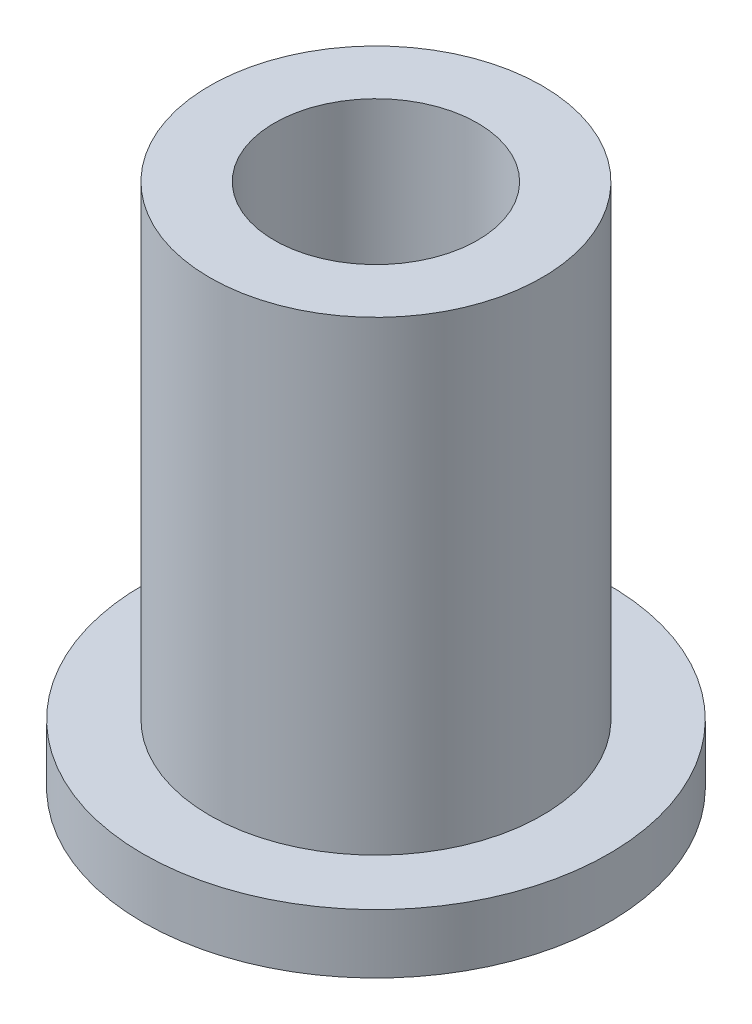
ISO-10303-21;
HEADER;
FILE_DESCRIPTION(('STEP AP214'),'2;1');
FILE_NAME('part.step','',(''),(''),'','','');
FILE_SCHEMA(('AUTOMOTIVE_DESIGN { 1 0 10303 214 1 1 1 1 }'));
ENDSEC;
DATA;
#1=APPLICATION_CONTEXT('core data for automotive mechanical design processes');
#2=APPLICATION_PROTOCOL_DEFINITION('international standard','automotive_design',2000,#1);
#3=PRODUCT_CONTEXT('',#1,'mechanical');
#4=PRODUCT('Part','Part','',(#3));
#5=PRODUCT_RELATED_PRODUCT_CATEGORY('part','',(#4));
#6=PRODUCT_DEFINITION_FORMATION('','',#4);
#7=PRODUCT_DEFINITION_CONTEXT('part definition',#1,'design');
#8=PRODUCT_DEFINITION('design','',#6,#7);
#9=PRODUCT_DEFINITION_SHAPE('','',#8);
#10=(LENGTH_UNIT() NAMED_UNIT(*) SI_UNIT(.MILLI.,.METRE.));
#11=(NAMED_UNIT(*) PLANE_ANGLE_UNIT() SI_UNIT($,.RADIAN.));
#12=(NAMED_UNIT(*) SI_UNIT($,.STERADIAN.) SOLID_ANGLE_UNIT());
#13=UNCERTAINTY_MEASURE_WITH_UNIT(LENGTH_MEASURE(1.E-05),#10,'distance_accuracy_value','');
#14=(GEOMETRIC_REPRESENTATION_CONTEXT(3) GLOBAL_UNCERTAINTY_ASSIGNED_CONTEXT((#13)) GLOBAL_UNIT_ASSIGNED_CONTEXT((#10,
#11,#12)) REPRESENTATION_CONTEXT('',''));
#15=CARTESIAN_POINT('',(0.,0.,0.));
#16=DIRECTION('',(0.,0.,1.));
#17=DIRECTION('',(1.,0.,0.));
#18=AXIS2_PLACEMENT_3D('',#15,#16,#17);
#19=CARTESIAN_POINT('',(0.,0.,0.));
#20=DIRECTION('',(0.,1.,0.));
#21=DIRECTION('',(0.,0.,1.));
#22=AXIS2_PLACEMENT_3D('',#19,#20,#21);
#23=PLANE('',#22);
#24=CARTESIAN_POINT('',(0.,5.6843418860808E-11,0.));
#25=DIRECTION('',(0.,-1.,0.));
#26=DIRECTION('',(0.,0.,-1.));
#27=AXIS2_PLACEMENT_3D('',#24,#25,#26);
#28=CIRCLE('',#27,2.59999999997262);
#29=CARTESIAN_POINT('',(0.,5.6843418860808E-11,-2.59999999997262));
#30=VERTEX_POINT('',#29);
#31=EDGE_CURVE('E17',#30,#30,#28,.F.);
#32=ORIENTED_EDGE('',*,*,#31,.T.);
#33=EDGE_LOOP('',(#32));
#34=FACE_BOUND('',#33,.T.);
#35=CARTESIAN_POINT('',(0.,0.,0.));
#36=DIRECTION('',(0.,1.,0.));
#37=DIRECTION('',(0.,0.,1.));
#38=AXIS2_PLACEMENT_3D('',#35,#36,#37);
#39=CIRCLE('',#38,5.5);
#40=CARTESIAN_POINT('',(0.,0.,5.5));
#41=VERTEX_POINT('',#40);
#42=EDGE_CURVE('E37',#41,#41,#39,.T.);
#43=ORIENTED_EDGE('',*,*,#42,.F.);
#44=EDGE_LOOP('',(#43));
#45=FACE_BOUND('',#44,.T.);
#46=ADVANCED_FACE('F14',(#34,#45),#23,.F.);
#47=CARTESIAN_POINT('',(0.,5.6843418860808E-11,0.));
#48=DIRECTION('',(0.,-1.,0.));
#49=DIRECTION('',(0.,0.,-1.));
#50=AXIS2_PLACEMENT_3D('',#47,#48,#49);
#51=CONICAL_SURFACE('',#50,2.59999999997262,0.785398163397448);
#52=CARTESIAN_POINT('',(0.,0.199999999999999,0.));
#53=DIRECTION('',(0.,-1.,0.));
#54=DIRECTION('',(0.,0.,-1.));
#55=AXIS2_PLACEMENT_3D('',#52,#53,#54);
#56=CIRCLE('',#55,2.4);
#57=CARTESIAN_POINT('',(0.,0.199999999999999,-2.4));
#58=VERTEX_POINT('',#57);
#59=EDGE_CURVE('E36',#58,#58,#56,.F.);
#60=ORIENTED_EDGE('',*,*,#59,.T.);
#61=EDGE_LOOP('',(#60));
#62=FACE_BOUND('',#61,.T.);
#63=ORIENTED_EDGE('',*,*,#31,.F.);
#64=EDGE_LOOP('',(#63));
#65=FACE_BOUND('',#64,.T.);
#66=ADVANCED_FACE('F47',(#62,#65),#51,.F.);
#67=CARTESIAN_POINT('',(0.,0.,0.));
#68=DIRECTION('',(0.,1.,0.));
#69=DIRECTION('',(0.,0.,1.));
#70=AXIS2_PLACEMENT_3D('',#67,#68,#69);
#71=CYLINDRICAL_SURFACE('',#70,5.5);
#72=CARTESIAN_POINT('',(0.,1.4,0.));
#73=DIRECTION('',(0.,1.,0.));
#74=DIRECTION('',(0.,0.,1.));
#75=AXIS2_PLACEMENT_3D('',#72,#73,#74);
#76=CIRCLE('',#75,5.5);
#77=CARTESIAN_POINT('',(0.,1.4,5.5));
#78=VERTEX_POINT('',#77);
#79=EDGE_CURVE('E34',#78,#78,#76,.T.);
#80=ORIENTED_EDGE('',*,*,#79,.F.);
#81=EDGE_LOOP('',(#80));
#82=FACE_BOUND('',#81,.T.);
#83=ORIENTED_EDGE('',*,*,#42,.T.);
#84=EDGE_LOOP('',(#83));
#85=FACE_BOUND('',#84,.T.);
#86=ADVANCED_FACE('F49',(#82,#85),#71,.T.);
#87=CARTESIAN_POINT('',(0.,12.4,0.));
#88=DIRECTION('',(0.,-1.,0.));
#89=DIRECTION('',(0.,0.,-1.));
#90=AXIS2_PLACEMENT_3D('',#87,#88,#89);
#91=CYLINDRICAL_SURFACE('',#90,2.4);
#92=CARTESIAN_POINT('',(0.,12.4,0.));
#93=DIRECTION('',(0.,-1.,0.));
#94=DIRECTION('',(0.,0.,-1.));
#95=AXIS2_PLACEMENT_3D('',#92,#93,#94);
#96=CIRCLE('',#95,2.4);
#97=CARTESIAN_POINT('',(0.,12.4,-2.4));
#98=VERTEX_POINT('',#97);
#99=EDGE_CURVE('E26',#98,#98,#96,.T.);
#100=ORIENTED_EDGE('',*,*,#99,.F.);
#101=EDGE_LOOP('',(#100));
#102=FACE_BOUND('',#101,.T.);
#103=ORIENTED_EDGE('',*,*,#59,.F.);
#104=EDGE_LOOP('',(#103));
#105=FACE_BOUND('',#104,.T.);
#106=ADVANCED_FACE('F56',(#102,#105),#91,.F.);
#107=CARTESIAN_POINT('',(0.,1.4,0.));
#108=DIRECTION('',(0.,1.,0.));
#109=DIRECTION('',(0.,0.,1.));
#110=AXIS2_PLACEMENT_3D('',#107,#108,#109);
#111=PLANE('',#110);
#112=CARTESIAN_POINT('',(0.,1.4,0.));
#113=DIRECTION('',(0.,1.,0.));
#114=DIRECTION('',(0.,0.,1.));
#115=AXIS2_PLACEMENT_3D('',#112,#113,#114);
#116=CIRCLE('',#115,3.925);
#117=CARTESIAN_POINT('',(0.,1.4,3.925));
#118=VERTEX_POINT('',#117);
#119=EDGE_CURVE('E21',#118,#118,#116,.T.);
#120=ORIENTED_EDGE('',*,*,#119,.F.);
#121=EDGE_LOOP('',(#120));
#122=FACE_BOUND('',#121,.T.);
#123=ORIENTED_EDGE('',*,*,#79,.T.);
#124=EDGE_LOOP('',(#123));
#125=FACE_BOUND('',#124,.T.);
#126=ADVANCED_FACE('F66',(#122,#125),#111,.T.);
#127=CARTESIAN_POINT('',(0.,12.4,0.));
#128=DIRECTION('',(0.,1.,0.));
#129=DIRECTION('',(0.,0.,1.));
#130=AXIS2_PLACEMENT_3D('',#127,#128,#129);
#131=PLANE('',#130);
#132=ORIENTED_EDGE('',*,*,#99,.T.);
#133=EDGE_LOOP('',(#132));
#134=FACE_BOUND('',#133,.T.);
#135=CARTESIAN_POINT('',(0.,12.4,0.));
#136=DIRECTION('',(0.,1.,0.));
#137=DIRECTION('',(0.,0.,1.));
#138=AXIS2_PLACEMENT_3D('',#135,#136,#137);
#139=CIRCLE('',#138,3.925);
#140=CARTESIAN_POINT('',(0.,12.4,3.925));
#141=VERTEX_POINT('',#140);
#142=EDGE_CURVE('E10',#141,#141,#139,.F.);
#143=ORIENTED_EDGE('',*,*,#142,.F.);
#144=EDGE_LOOP('',(#143));
#145=FACE_BOUND('',#144,.T.);
#146=ADVANCED_FACE('F61',(#134,#145),#131,.T.);
#147=CARTESIAN_POINT('',(0.,0.,0.));
#148=DIRECTION('',(0.,1.,0.));
#149=DIRECTION('',(0.,0.,1.));
#150=AXIS2_PLACEMENT_3D('',#147,#148,#149);
#151=CYLINDRICAL_SURFACE('',#150,3.925);
#152=ORIENTED_EDGE('',*,*,#142,.T.);
#153=EDGE_LOOP('',(#152));
#154=FACE_BOUND('',#153,.T.);
#155=ORIENTED_EDGE('',*,*,#119,.T.);
#156=EDGE_LOOP('',(#155));
#157=FACE_BOUND('',#156,.T.);
#158=ADVANCED_FACE('F59',(#154,#157),#151,.T.);
#159=CLOSED_SHELL('',(#46,#66,#86,#106,#126,#146,#158));
#160=MANIFOLD_SOLID_BREP('B1',#159);
#161=ADVANCED_BREP_SHAPE_REPRESENTATION('',(#18,#160),#14);
#162=SHAPE_DEFINITION_REPRESENTATION(#9,#161);
ENDSEC;
END-ISO-10303-21;
